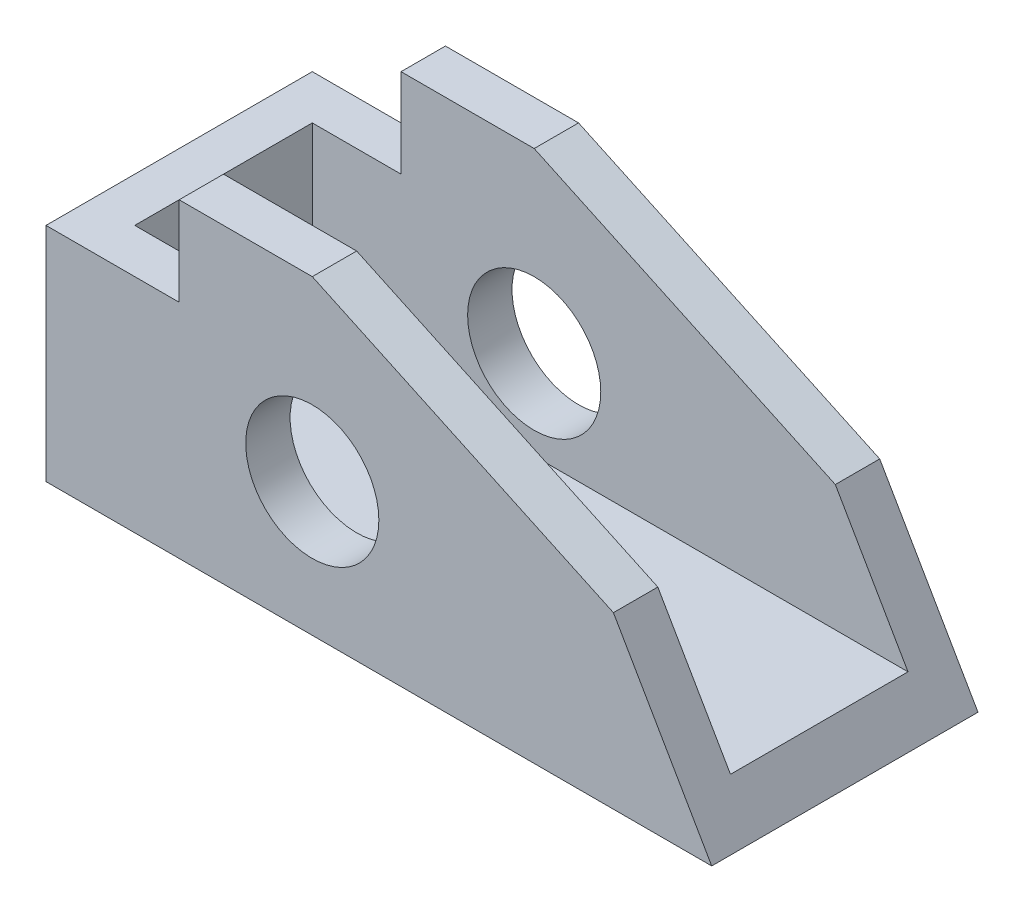
ISO-10303-21;
HEADER;
FILE_DESCRIPTION(('STEP AP214'),'2;1');
FILE_NAME('part.step','',(''),(''),'','','');
FILE_SCHEMA(('AUTOMOTIVE_DESIGN { 1 0 10303 214 1 1 1 1 }'));
ENDSEC;
DATA;
#1=APPLICATION_CONTEXT('core data for automotive mechanical design processes');
#2=APPLICATION_PROTOCOL_DEFINITION('international standard','automotive_design',2000,#1);
#3=PRODUCT_CONTEXT('',#1,'mechanical');
#4=PRODUCT('Part','Part','',(#3));
#5=PRODUCT_RELATED_PRODUCT_CATEGORY('part','',(#4));
#6=PRODUCT_DEFINITION_FORMATION('','',#4);
#7=PRODUCT_DEFINITION_CONTEXT('part definition',#1,'design');
#8=PRODUCT_DEFINITION('design','',#6,#7);
#9=PRODUCT_DEFINITION_SHAPE('','',#8);
#10=(LENGTH_UNIT() NAMED_UNIT(*) SI_UNIT(.MILLI.,.METRE.));
#11=(NAMED_UNIT(*) PLANE_ANGLE_UNIT() SI_UNIT($,.RADIAN.));
#12=(NAMED_UNIT(*) SI_UNIT($,.STERADIAN.) SOLID_ANGLE_UNIT());
#13=UNCERTAINTY_MEASURE_WITH_UNIT(LENGTH_MEASURE(1.E-05),#10,'distance_accuracy_value','');
#14=(GEOMETRIC_REPRESENTATION_CONTEXT(3) GLOBAL_UNCERTAINTY_ASSIGNED_CONTEXT((#13)) GLOBAL_UNIT_ASSIGNED_CONTEXT((#10,
#11,#12)) REPRESENTATION_CONTEXT('',''));
#15=CARTESIAN_POINT('',(0.,0.,0.));
#16=DIRECTION('',(0.,0.,1.));
#17=DIRECTION('',(1.,0.,0.));
#18=AXIS2_PLACEMENT_3D('',#15,#16,#17);
#19=CARTESIAN_POINT('',(19.05,44.45,-38.1));
#20=DIRECTION('',(-1.,0.,0.));
#21=DIRECTION('',(0.,-1.,0.));
#22=AXIS2_PLACEMENT_3D('',#19,#20,#21);
#23=PLANE('',#22);
#24=DIRECTION('',(0.,-1.,0.));
#25=VECTOR('',#24,1.);
#26=CARTESIAN_POINT('',(19.05,44.45,-31.75));
#27=LINE('',#26,#25);
#28=CARTESIAN_POINT('',(19.05,44.45,-31.75));
#29=VERTEX_POINT('',#28);
#30=CARTESIAN_POINT('',(19.05,31.75,-31.75));
#31=VERTEX_POINT('',#30);
#32=EDGE_CURVE('E117',#29,#31,#27,.T.);
#33=ORIENTED_EDGE('',*,*,#32,.F.);
#34=DIRECTION('',(0.,0.,1.));
#35=VECTOR('',#34,1.);
#36=CARTESIAN_POINT('',(19.05,44.45,-38.1));
#37=LINE('',#36,#35);
#38=CARTESIAN_POINT('',(19.05,44.45,-38.1));
#39=VERTEX_POINT('',#38);
#40=EDGE_CURVE('E110',#39,#29,#37,.T.);
#41=ORIENTED_EDGE('',*,*,#40,.F.);
#42=DIRECTION('',(0.,-1.,0.));
#43=VECTOR('',#42,1.);
#44=CARTESIAN_POINT('',(19.05,44.45,-38.1));
#45=LINE('',#44,#43);
#46=CARTESIAN_POINT('',(19.05,31.75,-38.1));
#47=VERTEX_POINT('',#46);
#48=EDGE_CURVE('E113',#39,#47,#45,.T.);
#49=ORIENTED_EDGE('',*,*,#48,.T.);
#50=DIRECTION('',(0.,0.,1.));
#51=VECTOR('',#50,1.);
#52=CARTESIAN_POINT('',(19.05,31.75,-38.1));
#53=LINE('',#52,#51);
#54=EDGE_CURVE('E166',#47,#31,#53,.T.);
#55=ORIENTED_EDGE('',*,*,#54,.T.);
#56=EDGE_LOOP('',(#33,#41,#49,#55));
#57=FACE_BOUND('',#56,.T.);
#58=ADVANCED_FACE('F33',(#57),#23,.T.);
#59=CARTESIAN_POINT('',(38.1,44.45,-38.1));
#60=DIRECTION('',(0.,1.,0.));
#61=DIRECTION('',(0.,0.,1.));
#62=AXIS2_PLACEMENT_3D('',#59,#60,#61);
#63=PLANE('',#62);
#64=DIRECTION('',(-1.,0.,0.));
#65=VECTOR('',#64,1.);
#66=CARTESIAN_POINT('',(6.35,44.45,-31.75));
#67=LINE('',#66,#65);
#68=CARTESIAN_POINT('',(38.1,44.45,-31.75));
#69=VERTEX_POINT('',#68);
#70=EDGE_CURVE('E223',#69,#29,#67,.T.);
#71=ORIENTED_EDGE('',*,*,#70,.F.);
#72=DIRECTION('',(0.,0.,1.));
#73=VECTOR('',#72,1.);
#74=CARTESIAN_POINT('',(38.1,44.45,-38.1));
#75=LINE('',#74,#73);
#76=CARTESIAN_POINT('',(38.1,44.45,-38.1));
#77=VERTEX_POINT('',#76);
#78=EDGE_CURVE('E134',#77,#69,#75,.T.);
#79=ORIENTED_EDGE('',*,*,#78,.F.);
#80=DIRECTION('',(-1.,0.,0.));
#81=VECTOR('',#80,1.);
#82=CARTESIAN_POINT('',(38.1,44.45,-38.1));
#83=LINE('',#82,#81);
#84=EDGE_CURVE('E128',#77,#39,#83,.T.);
#85=ORIENTED_EDGE('',*,*,#84,.T.);
#86=ORIENTED_EDGE('',*,*,#40,.T.);
#87=EDGE_LOOP('',(#71,#79,#85,#86));
#88=FACE_BOUND('',#87,.T.);
#89=ADVANCED_FACE('F132',(#88),#63,.T.);
#90=CARTESIAN_POINT('',(81.1867065548134,24.3583387688133,-38.1));
#91=DIRECTION('',(0.4226182617407,0.90630778703665,0.));
#92=DIRECTION('',(-0.906307787036649,0.4226182617407,0.));
#93=AXIS2_PLACEMENT_3D('',#90,#91,#92);
#94=PLANE('',#93);
#95=DIRECTION('',(-0.90630778703665,0.4226182617407,0.));
#96=VECTOR('',#95,1.);
#97=CARTESIAN_POINT('',(81.1867065548134,24.3583387688133,-31.75));
#98=LINE('',#97,#96);
#99=CARTESIAN_POINT('',(81.1867065548134,24.3583387688133,-31.75));
#100=VERTEX_POINT('',#99);
#101=EDGE_CURVE('E237',#100,#69,#98,.T.);
#102=ORIENTED_EDGE('',*,*,#101,.F.);
#103=DIRECTION('',(0.,0.,1.));
#104=VECTOR('',#103,1.);
#105=CARTESIAN_POINT('',(81.1867065548134,24.3583387688133,-38.1));
#106=LINE('',#105,#104);
#107=CARTESIAN_POINT('',(81.1867065548134,24.3583387688133,-38.1));
#108=VERTEX_POINT('',#107);
#109=EDGE_CURVE('E170',#108,#100,#106,.T.);
#110=ORIENTED_EDGE('',*,*,#109,.F.);
#111=DIRECTION('',(-0.906307787036649,0.4226182617407,0.));
#112=VECTOR('',#111,1.);
#113=CARTESIAN_POINT('',(81.1867065548134,24.3583387688133,-38.1));
#114=LINE('',#113,#112);
#115=EDGE_CURVE('E135',#108,#77,#114,.T.);
#116=ORIENTED_EDGE('',*,*,#115,.T.);
#117=ORIENTED_EDGE('',*,*,#78,.T.);
#118=EDGE_LOOP('',(#102,#110,#116,#117));
#119=FACE_BOUND('',#118,.T.);
#120=ADVANCED_FACE('F308',(#119),#94,.T.);
#121=CARTESIAN_POINT('',(38.1,19.05,-38.1));
#122=DIRECTION('',(0.,0.,1.));
#123=DIRECTION('',(1.,0.,0.));
#124=AXIS2_PLACEMENT_3D('',#121,#122,#123);
#125=CYLINDRICAL_SURFACE('',#124,9.525);
#126=CARTESIAN_POINT('',(38.1,19.05,-31.75));
#127=DIRECTION('',(0.,0.,-1.));
#128=DIRECTION('',(-1.,0.,0.));
#129=AXIS2_PLACEMENT_3D('',#126,#127,#128);
#130=CIRCLE('',#129,9.525);
#131=CARTESIAN_POINT('',(28.575,19.05,-31.75));
#132=VERTEX_POINT('',#131);
#133=EDGE_CURVE('E182',#132,#132,#130,.F.);
#134=ORIENTED_EDGE('',*,*,#133,.T.);
#135=EDGE_LOOP('',(#134));
#136=FACE_BOUND('',#135,.T.);
#137=CARTESIAN_POINT('',(38.1,19.05,-38.1));
#138=DIRECTION('',(0.,0.,1.));
#139=DIRECTION('',(1.,0.,0.));
#140=AXIS2_PLACEMENT_3D('',#137,#138,#139);
#141=CIRCLE('',#140,9.525);
#142=CARTESIAN_POINT('',(47.625,19.05,-38.1));
#143=VERTEX_POINT('',#142);
#144=EDGE_CURVE('E146',#143,#143,#141,.T.);
#145=ORIENTED_EDGE('',*,*,#144,.F.);
#146=EDGE_LOOP('',(#145));
#147=FACE_BOUND('',#146,.T.);
#148=ADVANCED_FACE('F312',(#136,#147),#125,.F.);
#149=CARTESIAN_POINT('',(0.,31.75,-38.1));
#150=DIRECTION('',(-1.,0.,0.));
#151=DIRECTION('',(0.,0.,1.));
#152=AXIS2_PLACEMENT_3D('',#149,#150,#151);
#153=PLANE('',#152);
#154=DIRECTION('',(0.,-1.,0.));
#155=VECTOR('',#154,1.);
#156=CARTESIAN_POINT('',(0.,31.75,0.));
#157=LINE('',#156,#155);
#158=CARTESIAN_POINT('',(0.,31.75,0.));
#159=VERTEX_POINT('',#158);
#160=CARTESIAN_POINT('',(0.,0.,0.));
#161=VERTEX_POINT('',#160);
#162=EDGE_CURVE('E142',#159,#161,#157,.T.);
#163=ORIENTED_EDGE('',*,*,#162,.F.);
#164=DIRECTION('',(0.,0.,1.));
#165=VECTOR('',#164,1.);
#166=CARTESIAN_POINT('',(0.,31.75,-38.1));
#167=LINE('',#166,#165);
#168=CARTESIAN_POINT('',(0.,31.75,-38.1));
#169=VERTEX_POINT('',#168);
#170=EDGE_CURVE('E57',#169,#159,#167,.T.);
#171=ORIENTED_EDGE('',*,*,#170,.F.);
#172=DIRECTION('',(0.,-1.,0.));
#173=VECTOR('',#172,1.);
#174=CARTESIAN_POINT('',(0.,31.75,-38.1));
#175=LINE('',#174,#173);
#176=CARTESIAN_POINT('',(0.,0.,-38.1));
#177=VERTEX_POINT('',#176);
#178=EDGE_CURVE('E164',#169,#177,#175,.T.);
#179=ORIENTED_EDGE('',*,*,#178,.T.);
#180=DIRECTION('',(0.,0.,1.));
#181=VECTOR('',#180,1.);
#182=CARTESIAN_POINT('',(0.,0.,-38.1));
#183=LINE('',#182,#181);
#184=EDGE_CURVE('E93',#177,#161,#183,.T.);
#185=ORIENTED_EDGE('',*,*,#184,.T.);
#186=EDGE_LOOP('',(#163,#171,#179,#185));
#187=FACE_BOUND('',#186,.T.);
#188=ADVANCED_FACE('F35',(#187),#153,.T.);
#189=CARTESIAN_POINT('',(19.05,31.75,-38.1));
#190=DIRECTION('',(0.,1.,0.));
#191=DIRECTION('',(0.,0.,1.));
#192=AXIS2_PLACEMENT_3D('',#189,#190,#191);
#193=PLANE('',#192);
#194=DIRECTION('',(-1.,0.,0.));
#195=VECTOR('',#194,1.);
#196=CARTESIAN_POINT('',(19.05,31.75,-31.75));
#197=LINE('',#196,#195);
#198=CARTESIAN_POINT('',(6.35,31.75,-31.75));
#199=VERTEX_POINT('',#198);
#200=EDGE_CURVE('E240',#31,#199,#197,.T.);
#201=ORIENTED_EDGE('',*,*,#200,.F.);
#202=ORIENTED_EDGE('',*,*,#54,.F.);
#203=DIRECTION('',(-1.,0.,0.));
#204=VECTOR('',#203,1.);
#205=CARTESIAN_POINT('',(19.05,31.75,-38.1));
#206=LINE('',#205,#204);
#207=EDGE_CURVE('E130',#47,#169,#206,.T.);
#208=ORIENTED_EDGE('',*,*,#207,.T.);
#209=ORIENTED_EDGE('',*,*,#170,.T.);
#210=DIRECTION('',(-1.,0.,0.));
#211=VECTOR('',#210,1.);
#212=CARTESIAN_POINT('',(19.05,31.75,0.));
#213=LINE('',#212,#211);
#214=CARTESIAN_POINT('',(19.05,31.75,0.));
#215=VERTEX_POINT('',#214);
#216=EDGE_CURVE('E161',#215,#159,#213,.T.);
#217=ORIENTED_EDGE('',*,*,#216,.F.);
#218=CARTESIAN_POINT('',(19.05,31.75,-6.35000000000001));
#219=VERTEX_POINT('',#218);
#220=EDGE_CURVE('E121',#219,#215,#53,.T.);
#221=ORIENTED_EDGE('',*,*,#220,.F.);
#222=DIRECTION('',(1.,0.,0.));
#223=VECTOR('',#222,1.);
#224=CARTESIAN_POINT('',(19.05,31.75,-6.35));
#225=LINE('',#224,#223);
#226=CARTESIAN_POINT('',(6.35,31.75,-6.35));
#227=VERTEX_POINT('',#226);
#228=EDGE_CURVE('E185',#227,#219,#225,.T.);
#229=ORIENTED_EDGE('',*,*,#228,.F.);
#230=DIRECTION('',(0.,0.,1.));
#231=VECTOR('',#230,1.);
#232=CARTESIAN_POINT('',(6.35,31.75,-38.1));
#233=LINE('',#232,#231);
#234=EDGE_CURVE('E11',#199,#227,#233,.T.);
#235=ORIENTED_EDGE('',*,*,#234,.F.);
#236=EDGE_LOOP('',(#201,#202,#208,#209,#217,#221,#229,#235));
#237=FACE_BOUND('',#236,.T.);
#238=ADVANCED_FACE('F257',(#237),#193,.T.);
#239=DIRECTION('',(0.,1.,0.));
#240=VECTOR('',#239,1.);
#241=CARTESIAN_POINT('',(19.05,44.45,-6.35000000000001));
#242=LINE('',#241,#240);
#243=CARTESIAN_POINT('',(19.05,44.45,-6.35));
#244=VERTEX_POINT('',#243);
#245=EDGE_CURVE('E231',#219,#244,#242,.T.);
#246=ORIENTED_EDGE('',*,*,#245,.F.);
#247=ORIENTED_EDGE('',*,*,#220,.T.);
#248=DIRECTION('',(0.,-1.,0.));
#249=VECTOR('',#248,1.);
#250=CARTESIAN_POINT('',(19.05,44.45,0.));
#251=LINE('',#250,#249);
#252=CARTESIAN_POINT('',(19.05,44.45,0.));
#253=VERTEX_POINT('',#252);
#254=EDGE_CURVE('E158',#253,#215,#251,.T.);
#255=ORIENTED_EDGE('',*,*,#254,.F.);
#256=EDGE_CURVE('E122',#244,#253,#37,.T.);
#257=ORIENTED_EDGE('',*,*,#256,.F.);
#258=EDGE_LOOP('',(#246,#247,#255,#257));
#259=FACE_BOUND('',#258,.T.);
#260=ADVANCED_FACE('F295',(#259),#23,.T.);
#261=DIRECTION('',(1.,0.,0.));
#262=VECTOR('',#261,1.);
#263=CARTESIAN_POINT('',(6.35,44.45,-6.35));
#264=LINE('',#263,#262);
#265=CARTESIAN_POINT('',(38.1,44.45,-6.35));
#266=VERTEX_POINT('',#265);
#267=EDGE_CURVE('E220',#244,#266,#264,.T.);
#268=ORIENTED_EDGE('',*,*,#267,.F.);
#269=ORIENTED_EDGE('',*,*,#256,.T.);
#270=DIRECTION('',(-1.,0.,0.));
#271=VECTOR('',#270,1.);
#272=CARTESIAN_POINT('',(38.1,44.45,0.));
#273=LINE('',#272,#271);
#274=CARTESIAN_POINT('',(38.1,44.45,0.));
#275=VERTEX_POINT('',#274);
#276=EDGE_CURVE('E155',#275,#253,#273,.T.);
#277=ORIENTED_EDGE('',*,*,#276,.F.);
#278=EDGE_CURVE('E169',#266,#275,#75,.T.);
#279=ORIENTED_EDGE('',*,*,#278,.F.);
#280=EDGE_LOOP('',(#268,#269,#277,#279));
#281=FACE_BOUND('',#280,.T.);
#282=ADVANCED_FACE('F289',(#281),#63,.T.);
#283=DIRECTION('',(0.90630778703665,-0.4226182617407,0.));
#284=VECTOR('',#283,1.);
#285=CARTESIAN_POINT('',(81.1867065548134,24.3583387688133,-6.35));
#286=LINE('',#285,#284);
#287=CARTESIAN_POINT('',(81.1867065548134,24.3583387688133,-6.35));
#288=VERTEX_POINT('',#287);
#289=EDGE_CURVE('E228',#266,#288,#286,.T.);
#290=ORIENTED_EDGE('',*,*,#289,.F.);
#291=ORIENTED_EDGE('',*,*,#278,.T.);
#292=DIRECTION('',(-0.906307787036649,0.4226182617407,0.));
#293=VECTOR('',#292,1.);
#294=CARTESIAN_POINT('',(81.1867065548134,24.3583387688133,0.));
#295=LINE('',#294,#293);
#296=CARTESIAN_POINT('',(81.1867065548134,24.3583387688133,0.));
#297=VERTEX_POINT('',#296);
#298=EDGE_CURVE('E152',#297,#275,#295,.T.);
#299=ORIENTED_EDGE('',*,*,#298,.F.);
#300=EDGE_CURVE('E173',#288,#297,#106,.T.);
#301=ORIENTED_EDGE('',*,*,#300,.F.);
#302=EDGE_LOOP('',(#290,#291,#299,#301));
#303=FACE_BOUND('',#302,.T.);
#304=ADVANCED_FACE('F286',(#303),#94,.T.);
#305=CARTESIAN_POINT('',(95.25,0.,-38.1));
#306=DIRECTION('',(0.866025403784436,0.500000000000005,0.));
#307=DIRECTION('',(-0.500000000000005,0.866025403784436,0.));
#308=AXIS2_PLACEMENT_3D('',#305,#306,#307);
#309=PLANE('',#308);
#310=DIRECTION('',(-0.500000000000005,0.866025403784436,0.));
#311=VECTOR('',#310,1.);
#312=CARTESIAN_POINT('',(95.25,0.,-31.75));
#313=LINE('',#312,#311);
#314=CARTESIAN_POINT('',(91.5838257906458,6.34999999999999,-31.75));
#315=VERTEX_POINT('',#314);
#316=EDGE_CURVE('E184',#315,#100,#313,.T.);
#317=ORIENTED_EDGE('',*,*,#316,.F.);
#318=DIRECTION('',(0.,0.,1.));
#319=VECTOR('',#318,1.);
#320=CARTESIAN_POINT('',(91.5838257906458,6.34999999999999,-38.1));
#321=LINE('',#320,#319);
#322=CARTESIAN_POINT('',(91.5838257906458,6.34999999999999,-6.35));
#323=VERTEX_POINT('',#322);
#324=EDGE_CURVE('E41',#315,#323,#321,.T.);
#325=ORIENTED_EDGE('',*,*,#324,.T.);
#326=DIRECTION('',(0.500000000000005,-0.866025403784436,0.));
#327=VECTOR('',#326,1.);
#328=CARTESIAN_POINT('',(95.25,0.,-6.35));
#329=LINE('',#328,#327);
#330=EDGE_CURVE('E180',#288,#323,#329,.T.);
#331=ORIENTED_EDGE('',*,*,#330,.F.);
#332=ORIENTED_EDGE('',*,*,#300,.T.);
#333=DIRECTION('',(-0.500000000000004,0.866025403784436,0.));
#334=VECTOR('',#333,1.);
#335=CARTESIAN_POINT('',(95.25,0.,0.));
#336=LINE('',#335,#334);
#337=CARTESIAN_POINT('',(95.25,0.,0.));
#338=VERTEX_POINT('',#337);
#339=EDGE_CURVE('E149',#338,#297,#336,.T.);
#340=ORIENTED_EDGE('',*,*,#339,.F.);
#341=DIRECTION('',(0.,0.,1.));
#342=VECTOR('',#341,1.);
#343=CARTESIAN_POINT('',(95.25,0.,-38.1));
#344=LINE('',#343,#342);
#345=CARTESIAN_POINT('',(95.25,0.,-38.1));
#346=VERTEX_POINT('',#345);
#347=EDGE_CURVE('E174',#346,#338,#344,.T.);
#348=ORIENTED_EDGE('',*,*,#347,.F.);
#349=DIRECTION('',(-0.500000000000004,0.866025403784436,0.));
#350=VECTOR('',#349,1.);
#351=CARTESIAN_POINT('',(95.25,0.,-38.1));
#352=LINE('',#351,#350);
#353=EDGE_CURVE('E137',#346,#108,#352,.T.);
#354=ORIENTED_EDGE('',*,*,#353,.T.);
#355=ORIENTED_EDGE('',*,*,#109,.T.);
#356=EDGE_LOOP('',(#317,#325,#331,#332,#340,#348,#354,#355));
#357=FACE_BOUND('',#356,.T.);
#358=ADVANCED_FACE('F190',(#357),#309,.T.);
#359=CARTESIAN_POINT('',(0.,0.,-38.1));
#360=DIRECTION('',(0.,-1.,0.));
#361=DIRECTION('',(0.,0.,-1.));
#362=AXIS2_PLACEMENT_3D('',#359,#360,#361);
#363=PLANE('',#362);
#364=DIRECTION('',(1.,0.,0.));
#365=VECTOR('',#364,1.);
#366=CARTESIAN_POINT('',(0.,0.,0.));
#367=LINE('',#366,#365);
#368=EDGE_CURVE('E145',#161,#338,#367,.T.);
#369=ORIENTED_EDGE('',*,*,#368,.F.);
#370=ORIENTED_EDGE('',*,*,#184,.F.);
#371=DIRECTION('',(1.,0.,0.));
#372=VECTOR('',#371,1.);
#373=CARTESIAN_POINT('',(0.,0.,-38.1));
#374=LINE('',#373,#372);
#375=EDGE_CURVE('E248',#177,#346,#374,.T.);
#376=ORIENTED_EDGE('',*,*,#375,.T.);
#377=ORIENTED_EDGE('',*,*,#347,.T.);
#378=EDGE_LOOP('',(#369,#370,#376,#377));
#379=FACE_BOUND('',#378,.T.);
#380=ADVANCED_FACE('F252',(#379),#363,.T.);
#381=CARTESIAN_POINT('',(0.,0.,-38.1));
#382=DIRECTION('',(0.,0.,1.));
#383=DIRECTION('',(1.,0.,0.));
#384=AXIS2_PLACEMENT_3D('',#381,#382,#383);
#385=PLANE('',#384);
#386=ORIENTED_EDGE('',*,*,#144,.T.);
#387=EDGE_LOOP('',(#386));
#388=FACE_BOUND('',#387,.T.);
#389=ORIENTED_EDGE('',*,*,#178,.F.);
#390=ORIENTED_EDGE('',*,*,#207,.F.);
#391=ORIENTED_EDGE('',*,*,#48,.F.);
#392=ORIENTED_EDGE('',*,*,#84,.F.);
#393=ORIENTED_EDGE('',*,*,#115,.F.);
#394=ORIENTED_EDGE('',*,*,#353,.F.);
#395=ORIENTED_EDGE('',*,*,#375,.F.);
#396=EDGE_LOOP('',(#389,#390,#391,#392,#393,#394,#395));
#397=FACE_BOUND('',#396,.T.);
#398=ADVANCED_FACE('F126',(#388,#397),#385,.F.);
#399=CARTESIAN_POINT('',(0.,0.,0.));
#400=DIRECTION('',(0.,0.,1.));
#401=DIRECTION('',(1.,0.,0.));
#402=AXIS2_PLACEMENT_3D('',#399,#400,#401);
#403=PLANE('',#402);
#404=CARTESIAN_POINT('',(38.1,19.05,0.));
#405=DIRECTION('',(0.,0.,1.));
#406=DIRECTION('',(1.,0.,0.));
#407=AXIS2_PLACEMENT_3D('',#404,#405,#406);
#408=CIRCLE('',#407,9.525);
#409=CARTESIAN_POINT('',(47.625,19.05,0.));
#410=VERTEX_POINT('',#409);
#411=EDGE_CURVE('E242',#410,#410,#408,.T.);
#412=ORIENTED_EDGE('',*,*,#411,.F.);
#413=EDGE_LOOP('',(#412));
#414=FACE_BOUND('',#413,.T.);
#415=ORIENTED_EDGE('',*,*,#162,.T.);
#416=ORIENTED_EDGE('',*,*,#368,.T.);
#417=ORIENTED_EDGE('',*,*,#339,.T.);
#418=ORIENTED_EDGE('',*,*,#298,.T.);
#419=ORIENTED_EDGE('',*,*,#276,.T.);
#420=ORIENTED_EDGE('',*,*,#254,.T.);
#421=ORIENTED_EDGE('',*,*,#216,.T.);
#422=EDGE_LOOP('',(#415,#416,#417,#418,#419,#420,#421));
#423=FACE_BOUND('',#422,.T.);
#424=ADVANCED_FACE('F255',(#414,#423),#403,.T.);
#425=CARTESIAN_POINT('',(38.1,19.05,-6.35000000000001));
#426=DIRECTION('',(0.,0.,1.));
#427=DIRECTION('',(1.,0.,0.));
#428=AXIS2_PLACEMENT_3D('',#425,#426,#427);
#429=CIRCLE('',#428,9.525);
#430=CARTESIAN_POINT('',(47.625,19.05,-6.35000000000001));
#431=VERTEX_POINT('',#430);
#432=EDGE_CURVE('E177',#431,#431,#429,.F.);
#433=ORIENTED_EDGE('',*,*,#432,.T.);
#434=EDGE_LOOP('',(#433));
#435=FACE_BOUND('',#434,.T.);
#436=ORIENTED_EDGE('',*,*,#411,.T.);
#437=EDGE_LOOP('',(#436));
#438=FACE_BOUND('',#437,.T.);
#439=ADVANCED_FACE('F327',(#435,#438),#125,.F.);
#440=CARTESIAN_POINT('',(6.35,6.34999999999999,-31.75));
#441=DIRECTION('',(0.,0.,-1.));
#442=DIRECTION('',(-1.,0.,0.));
#443=AXIS2_PLACEMENT_3D('',#440,#441,#442);
#444=PLANE('',#443);
#445=ORIENTED_EDGE('',*,*,#200,.T.);
#446=DIRECTION('',(0.,1.,0.));
#447=VECTOR('',#446,1.);
#448=CARTESIAN_POINT('',(6.35,6.34999999999999,-31.75));
#449=LINE('',#448,#447);
#450=CARTESIAN_POINT('',(6.35,6.34999999999999,-31.75));
#451=VERTEX_POINT('',#450);
#452=EDGE_CURVE('E181',#451,#199,#449,.T.);
#453=ORIENTED_EDGE('',*,*,#452,.F.);
#454=DIRECTION('',(-1.,0.,0.));
#455=VECTOR('',#454,1.);
#456=CARTESIAN_POINT('',(6.35,6.34999999999999,-31.75));
#457=LINE('',#456,#455);
#458=EDGE_CURVE('E199',#315,#451,#457,.T.);
#459=ORIENTED_EDGE('',*,*,#458,.F.);
#460=ORIENTED_EDGE('',*,*,#316,.T.);
#461=ORIENTED_EDGE('',*,*,#101,.T.);
#462=ORIENTED_EDGE('',*,*,#70,.T.);
#463=ORIENTED_EDGE('',*,*,#32,.T.);
#464=EDGE_LOOP('',(#445,#453,#459,#460,#461,#462,#463));
#465=FACE_BOUND('',#464,.T.);
#466=ORIENTED_EDGE('',*,*,#133,.F.);
#467=EDGE_LOOP('',(#466));
#468=FACE_BOUND('',#467,.T.);
#469=ADVANCED_FACE('F205',(#465,#468),#444,.F.);
#470=CARTESIAN_POINT('',(6.35,6.34999999999999,-6.35));
#471=DIRECTION('',(0.,0.,1.));
#472=DIRECTION('',(1.,0.,0.));
#473=AXIS2_PLACEMENT_3D('',#470,#471,#472);
#474=PLANE('',#473);
#475=ORIENTED_EDGE('',*,*,#228,.T.);
#476=ORIENTED_EDGE('',*,*,#245,.T.);
#477=ORIENTED_EDGE('',*,*,#267,.T.);
#478=ORIENTED_EDGE('',*,*,#289,.T.);
#479=ORIENTED_EDGE('',*,*,#330,.T.);
#480=DIRECTION('',(1.,0.,0.));
#481=VECTOR('',#480,1.);
#482=CARTESIAN_POINT('',(6.35,6.34999999999999,-6.35));
#483=LINE('',#482,#481);
#484=CARTESIAN_POINT('',(6.35,6.34999999999999,-6.35));
#485=VERTEX_POINT('',#484);
#486=EDGE_CURVE('E48',#485,#323,#483,.T.);
#487=ORIENTED_EDGE('',*,*,#486,.F.);
#488=DIRECTION('',(0.,1.,0.));
#489=VECTOR('',#488,1.);
#490=CARTESIAN_POINT('',(6.35,6.34999999999999,-6.35));
#491=LINE('',#490,#489);
#492=EDGE_CURVE('E212',#485,#227,#491,.T.);
#493=ORIENTED_EDGE('',*,*,#492,.T.);
#494=EDGE_LOOP('',(#475,#476,#477,#478,#479,#487,#493));
#495=FACE_BOUND('',#494,.T.);
#496=ORIENTED_EDGE('',*,*,#432,.F.);
#497=EDGE_LOOP('',(#496));
#498=FACE_BOUND('',#497,.T.);
#499=ADVANCED_FACE('F280',(#495,#498),#474,.F.);
#500=CARTESIAN_POINT('',(6.35,6.34999999999999,-31.75));
#501=DIRECTION('',(-1.,0.,0.));
#502=DIRECTION('',(0.,0.,1.));
#503=AXIS2_PLACEMENT_3D('',#500,#501,#502);
#504=PLANE('',#503);
#505=ORIENTED_EDGE('',*,*,#234,.T.);
#506=ORIENTED_EDGE('',*,*,#492,.F.);
#507=DIRECTION('',(0.,0.,1.));
#508=VECTOR('',#507,1.);
#509=CARTESIAN_POINT('',(6.35,6.34999999999999,-31.75));
#510=LINE('',#509,#508);
#511=EDGE_CURVE('E216',#451,#485,#510,.T.);
#512=ORIENTED_EDGE('',*,*,#511,.F.);
#513=ORIENTED_EDGE('',*,*,#452,.T.);
#514=EDGE_LOOP('',(#505,#506,#512,#513));
#515=FACE_BOUND('',#514,.T.);
#516=ADVANCED_FACE('F277',(#515),#504,.F.);
#517=CARTESIAN_POINT('',(0.,6.34999999999999,0.));
#518=DIRECTION('',(0.,1.,0.));
#519=DIRECTION('',(0.,0.,1.));
#520=AXIS2_PLACEMENT_3D('',#517,#518,#519);
#521=PLANE('',#520);
#522=ORIENTED_EDGE('',*,*,#458,.T.);
#523=ORIENTED_EDGE('',*,*,#511,.T.);
#524=ORIENTED_EDGE('',*,*,#486,.T.);
#525=ORIENTED_EDGE('',*,*,#324,.F.);
#526=EDGE_LOOP('',(#522,#523,#524,#525));
#527=FACE_BOUND('',#526,.T.);
#528=ADVANCED_FACE('F197',(#527),#521,.T.);
#529=CLOSED_SHELL('',(#58,#89,#120,#148,#188,#238,#260,#282,#304,#358,#380,#398,#424,#439,#469,
#499,#516,#528));
#530=MANIFOLD_SOLID_BREP('B2',#529);
#531=ADVANCED_BREP_SHAPE_REPRESENTATION('',(#18,#530),#14);
#532=SHAPE_DEFINITION_REPRESENTATION(#9,#531);
ENDSEC;
END-ISO-10303-21;
